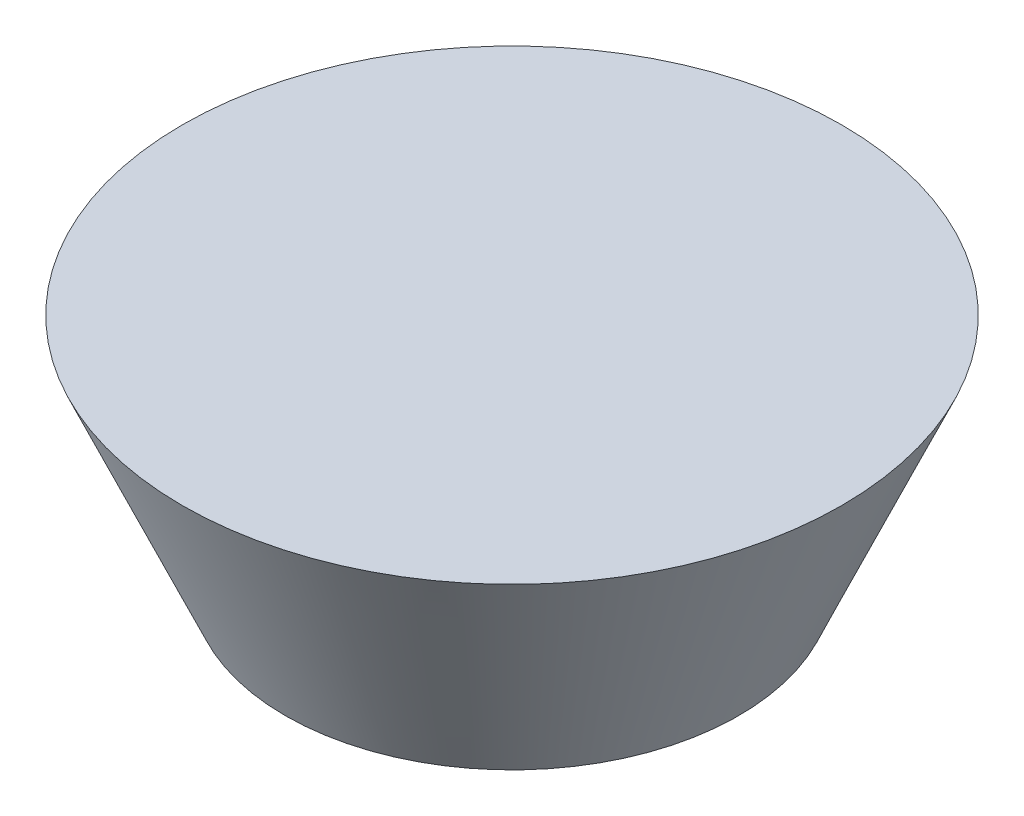
ISO-10303-21;
HEADER;
FILE_DESCRIPTION(('STEP AP214'),'2;1');
FILE_NAME('part.step','',(''),(''),'','','');
FILE_SCHEMA(('AUTOMOTIVE_DESIGN { 1 0 10303 214 1 1 1 1 }'));
ENDSEC;
DATA;
#1=APPLICATION_CONTEXT('core data for automotive mechanical design processes');
#2=APPLICATION_PROTOCOL_DEFINITION('international standard','automotive_design',2000,#1);
#3=PRODUCT_CONTEXT('',#1,'mechanical');
#4=PRODUCT('Part','Part','',(#3));
#5=PRODUCT_RELATED_PRODUCT_CATEGORY('part','',(#4));
#6=PRODUCT_DEFINITION_FORMATION('','',#4);
#7=PRODUCT_DEFINITION_CONTEXT('part definition',#1,'design');
#8=PRODUCT_DEFINITION('design','',#6,#7);
#9=PRODUCT_DEFINITION_SHAPE('','',#8);
#10=(LENGTH_UNIT() NAMED_UNIT(*) SI_UNIT(.MILLI.,.METRE.));
#11=(NAMED_UNIT(*) PLANE_ANGLE_UNIT() SI_UNIT($,.RADIAN.));
#12=(NAMED_UNIT(*) SI_UNIT($,.STERADIAN.) SOLID_ANGLE_UNIT());
#13=UNCERTAINTY_MEASURE_WITH_UNIT(LENGTH_MEASURE(1.E-05),#10,'distance_accuracy_value','');
#14=(GEOMETRIC_REPRESENTATION_CONTEXT(3) GLOBAL_UNCERTAINTY_ASSIGNED_CONTEXT((#13)) GLOBAL_UNIT_ASSIGNED_CONTEXT((#10,
#11,#12)) REPRESENTATION_CONTEXT('',''));
#15=CARTESIAN_POINT('',(0.,0.,0.));
#16=DIRECTION('',(0.,0.,1.));
#17=DIRECTION('',(1.,0.,0.));
#18=AXIS2_PLACEMENT_3D('',#15,#16,#17);
#19=CARTESIAN_POINT('',(0.,1.01,0.));
#20=DIRECTION('',(0.,-1.,0.));
#21=DIRECTION('',(0.,0.,-1.));
#22=AXIS2_PLACEMENT_3D('',#19,#20,#21);
#23=PLANE('',#22);
#24=CARTESIAN_POINT('',(0.,1.00999999995111,0.));
#25=DIRECTION('',(0.,1.,0.));
#26=DIRECTION('',(0.,0.,1.));
#27=AXIS2_PLACEMENT_3D('',#24,#25,#26);
#28=CIRCLE('',#27,0.824999999985173);
#29=CARTESIAN_POINT('',(0.,1.00999999995111,0.824999999985173));
#30=VERTEX_POINT('',#29);
#31=EDGE_CURVE('E18',#30,#30,#28,.T.);
#32=ORIENTED_EDGE('',*,*,#31,.F.);
#33=EDGE_LOOP('',(#32));
#34=FACE_BOUND('',#33,.T.);
#35=ADVANCED_FACE('F15',(#34),#23,.T.);
#36=CARTESIAN_POINT('',(0.,1.86000000002196,0.));
#37=DIRECTION('',(0.,1.,0.));
#38=DIRECTION('',(0.,0.,1.));
#39=AXIS2_PLACEMENT_3D('',#36,#37,#38);
#40=CONICAL_SURFACE('',#39,1.20000000001141,0.415492095935951);
#41=CARTESIAN_POINT('',(0.,1.86000000002195,0.));
#42=DIRECTION('',(0.,1.,0.));
#43=DIRECTION('',(0.,0.,1.));
#44=AXIS2_PLACEMENT_3D('',#41,#42,#43);
#45=CIRCLE('',#44,1.20000000001141);
#46=CARTESIAN_POINT('',(0.,1.86000000002196,1.20000000001141));
#47=VERTEX_POINT('',#46);
#48=EDGE_CURVE('E10',#47,#47,#45,.T.);
#49=ORIENTED_EDGE('',*,*,#48,.F.);
#50=EDGE_LOOP('',(#49));
#51=FACE_BOUND('',#50,.T.);
#52=ORIENTED_EDGE('',*,*,#31,.T.);
#53=EDGE_LOOP('',(#52));
#54=FACE_BOUND('',#53,.T.);
#55=ADVANCED_FACE('F27',(#51,#54),#40,.T.);
#56=CARTESIAN_POINT('',(0.,1.86,0.));
#57=DIRECTION('',(0.,1.,0.));
#58=DIRECTION('',(0.,0.,1.));
#59=AXIS2_PLACEMENT_3D('',#56,#57,#58);
#60=PLANE('',#59);
#61=ORIENTED_EDGE('',*,*,#48,.T.);
#62=EDGE_LOOP('',(#61));
#63=FACE_BOUND('',#62,.T.);
#64=ADVANCED_FACE('F34',(#63),#60,.T.);
#65=CLOSED_SHELL('',(#35,#55,#64));
#66=MANIFOLD_SOLID_BREP('B1',#65);
#67=ADVANCED_BREP_SHAPE_REPRESENTATION('',(#18,#66),#14);
#68=SHAPE_DEFINITION_REPRESENTATION(#9,#67);
ENDSEC;
END-ISO-10303-21;
